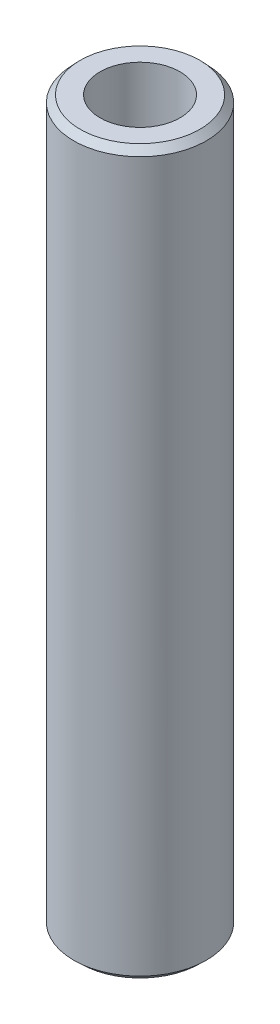
ISO-10303-21;
HEADER;
FILE_DESCRIPTION(('STEP AP214'),'2;1');
FILE_NAME('part.step','',(''),(''),'','','');
FILE_SCHEMA(('AUTOMOTIVE_DESIGN { 1 0 10303 214 1 1 1 1 }'));
ENDSEC;
DATA;
#1=APPLICATION_CONTEXT('core data for automotive mechanical design processes');
#2=APPLICATION_PROTOCOL_DEFINITION('international standard','automotive_design',2000,#1);
#3=PRODUCT_CONTEXT('',#1,'mechanical');
#4=PRODUCT('Part','Part','',(#3));
#5=PRODUCT_RELATED_PRODUCT_CATEGORY('part','',(#4));
#6=PRODUCT_DEFINITION_FORMATION('','',#4);
#7=PRODUCT_DEFINITION_CONTEXT('part definition',#1,'design');
#8=PRODUCT_DEFINITION('design','',#6,#7);
#9=PRODUCT_DEFINITION_SHAPE('','',#8);
#10=(LENGTH_UNIT() NAMED_UNIT(*) SI_UNIT(.MILLI.,.METRE.));
#11=(NAMED_UNIT(*) PLANE_ANGLE_UNIT() SI_UNIT($,.RADIAN.));
#12=(NAMED_UNIT(*) SI_UNIT($,.STERADIAN.) SOLID_ANGLE_UNIT());
#13=UNCERTAINTY_MEASURE_WITH_UNIT(LENGTH_MEASURE(1.E-05),#10,'distance_accuracy_value','');
#14=(GEOMETRIC_REPRESENTATION_CONTEXT(3) GLOBAL_UNCERTAINTY_ASSIGNED_CONTEXT((#13)) GLOBAL_UNIT_ASSIGNED_CONTEXT((#10,
#11,#12)) REPRESENTATION_CONTEXT('',''));
#15=CARTESIAN_POINT('',(0.,0.,0.));
#16=DIRECTION('',(0.,0.,1.));
#17=DIRECTION('',(1.,0.,0.));
#18=AXIS2_PLACEMENT_3D('',#15,#16,#17);
#19=CARTESIAN_POINT('',(0.,600.,0.));
#20=DIRECTION('',(0.,-1.,0.));
#21=DIRECTION('',(0.,0.,-1.));
#22=AXIS2_PLACEMENT_3D('',#19,#20,#21);
#23=CYLINDRICAL_SURFACE('',#22,55.);
#24=CARTESIAN_POINT('',(0.,594.356349089903,0.));
#25=DIRECTION('',(0.,1.,0.));
#26=DIRECTION('',(0.,0.,1.));
#27=AXIS2_PLACEMENT_3D('',#24,#25,#26);
#28=CIRCLE('',#27,55.);
#29=CARTESIAN_POINT('',(0.,594.356349089903,-55.));
#30=VERTEX_POINT('',#29);
#31=EDGE_CURVE('E50',#30,#30,#28,.F.);
#32=ORIENTED_EDGE('',*,*,#31,.T.);
#33=EDGE_LOOP('',(#32));
#34=FACE_BOUND('',#33,.T.);
#35=CARTESIAN_POINT('',(0.,5.33712912611228,0.));
#36=DIRECTION('',(0.,1.,0.));
#37=DIRECTION('',(0.,0.,1.));
#38=AXIS2_PLACEMENT_3D('',#35,#36,#37);
#39=CIRCLE('',#38,55.);
#40=CARTESIAN_POINT('',(0.,5.33712912611228,55.));
#41=VERTEX_POINT('',#40);
#42=EDGE_CURVE('E51',#41,#41,#39,.T.);
#43=ORIENTED_EDGE('',*,*,#42,.T.);
#44=EDGE_LOOP('',(#43));
#45=FACE_BOUND('',#44,.T.);
#46=ADVANCED_FACE('F39',(#34,#45),#23,.T.);
#47=CARTESIAN_POINT('',(0.,600.,0.));
#48=DIRECTION('',(0.,1.,0.));
#49=DIRECTION('',(0.,0.,1.));
#50=AXIS2_PLACEMENT_3D('',#47,#48,#49);
#51=PLANE('',#50);
#52=CARTESIAN_POINT('',(0.,600.,0.));
#53=DIRECTION('',(0.,1.,0.));
#54=DIRECTION('',(0.,0.,1.));
#55=AXIS2_PLACEMENT_3D('',#52,#53,#54);
#56=CIRCLE('',#55,49.6628708738877);
#57=CARTESIAN_POINT('',(0.,600.,-49.6628708738878));
#58=VERTEX_POINT('',#57);
#59=EDGE_CURVE('E54',#58,#58,#56,.T.);
#60=ORIENTED_EDGE('',*,*,#59,.T.);
#61=EDGE_LOOP('',(#60));
#62=FACE_BOUND('',#61,.T.);
#63=CARTESIAN_POINT('',(0.,600.,0.));
#64=DIRECTION('',(0.,1.,0.));
#65=DIRECTION('',(0.,0.,1.));
#66=AXIS2_PLACEMENT_3D('',#63,#64,#65);
#67=CIRCLE('',#66,33.1769553771118);
#68=CARTESIAN_POINT('',(0.,600.,33.1769553771118));
#69=VERTEX_POINT('',#68);
#70=EDGE_CURVE('E58',#69,#69,#67,.T.);
#71=ORIENTED_EDGE('',*,*,#70,.F.);
#72=EDGE_LOOP('',(#71));
#73=FACE_BOUND('',#72,.T.);
#74=ADVANCED_FACE('F69',(#62,#73),#51,.T.);
#75=CARTESIAN_POINT('',(0.,0.,0.));
#76=DIRECTION('',(0.,1.,0.));
#77=DIRECTION('',(0.,0.,1.));
#78=AXIS2_PLACEMENT_3D('',#75,#76,#77);
#79=PLANE('',#78);
#80=CARTESIAN_POINT('',(0.,0.,0.));
#81=DIRECTION('',(0.,1.,0.));
#82=DIRECTION('',(0.,0.,1.));
#83=AXIS2_PLACEMENT_3D('',#80,#81,#82);
#84=CIRCLE('',#83,49.3563490899028);
#85=CARTESIAN_POINT('',(0.,0.,49.3563490899028));
#86=VERTEX_POINT('',#85);
#87=EDGE_CURVE('E10',#86,#86,#84,.F.);
#88=ORIENTED_EDGE('',*,*,#87,.T.);
#89=EDGE_LOOP('',(#88));
#90=FACE_BOUND('',#89,.T.);
#91=CARTESIAN_POINT('',(0.,0.,0.));
#92=DIRECTION('',(0.,1.,0.));
#93=DIRECTION('',(0.,0.,1.));
#94=AXIS2_PLACEMENT_3D('',#91,#92,#93);
#95=CIRCLE('',#94,33.1769553771118);
#96=CARTESIAN_POINT('',(0.,0.,33.1769553771118));
#97=VERTEX_POINT('',#96);
#98=EDGE_CURVE('E63',#97,#97,#95,.T.);
#99=ORIENTED_EDGE('',*,*,#98,.T.);
#100=EDGE_LOOP('',(#99));
#101=FACE_BOUND('',#100,.T.);
#102=ADVANCED_FACE('F75',(#90,#101),#79,.F.);
#103=CARTESIAN_POINT('',(0.,600.,0.));
#104=DIRECTION('',(0.,-1.,0.));
#105=DIRECTION('',(0.,0.,-1.));
#106=AXIS2_PLACEMENT_3D('',#103,#104,#105);
#107=CYLINDRICAL_SURFACE('',#106,33.1769553771118);
#108=ORIENTED_EDGE('',*,*,#70,.T.);
#109=EDGE_LOOP('',(#108));
#110=FACE_BOUND('',#109,.T.);
#111=ORIENTED_EDGE('',*,*,#98,.F.);
#112=EDGE_LOOP('',(#111));
#113=FACE_BOUND('',#112,.T.);
#114=ADVANCED_FACE('F70',(#110,#113),#107,.F.);
#115=CARTESIAN_POINT('',(0.,600.,0.));
#116=DIRECTION('',(0.,-1.,0.));
#117=DIRECTION('',(0.,0.,-1.));
#118=AXIS2_PLACEMENT_3D('',#115,#116,#117);
#119=CONICAL_SURFACE('',#118,49.6628708738877,0.757491019742651);
#120=CARTESIAN_POINT('',(0.,594.356349089903,-55.));
#121=CARTESIAN_POINT('',(0.,594.415137120216,-54.9444049049363));
#122=CARTESIAN_POINT('',(0.,594.47392515053,-54.8888098098727));
#123=CARTESIAN_POINT('',(0.,594.591501211157,-54.7776196197454));
#124=CARTESIAN_POINT('',(0.,594.65028924147,-54.7220245246817));
#125=CARTESIAN_POINT('',(0.,594.767865302097,-54.6108343345544));
#126=CARTESIAN_POINT('',(0.,594.826653332411,-54.5552392394907));
#127=CARTESIAN_POINT('',(0.,594.944229393038,-54.4440490493633));
#128=CARTESIAN_POINT('',(0.,595.003017423351,-54.3884539542997));
#129=CARTESIAN_POINT('',(0.,595.120593483979,-54.2772637641723));
#130=CARTESIAN_POINT('',(0.,595.179381514292,-54.2216686691087));
#131=CARTESIAN_POINT('',(0.,595.296957574919,-54.1104784789813));
#132=CARTESIAN_POINT('',(0.,595.355745605233,-54.0548833839177));
#133=CARTESIAN_POINT('',(0.,595.47332166586,-53.9436931937903));
#134=CARTESIAN_POINT('',(0.,595.532109696173,-53.8880980987267));
#135=CARTESIAN_POINT('',(0.,595.6496857568,-53.7769079085993));
#136=CARTESIAN_POINT('',(0.,595.708473787114,-53.7213128135357));
#137=CARTESIAN_POINT('',(0.,595.826049847741,-53.6101226234083));
#138=CARTESIAN_POINT('',(0.,595.884837878054,-53.5545275283446));
#139=CARTESIAN_POINT('',(0.,596.002413938681,-53.4433373382173));
#140=CARTESIAN_POINT('',(0.,596.061201968995,-53.3877422431536));
#141=CARTESIAN_POINT('',(0.,596.178778029622,-53.2765520530263));
#142=CARTESIAN_POINT('',(0.,596.237566059935,-53.2209569579626));
#143=CARTESIAN_POINT('',(0.,596.355142120562,-53.1097667678353));
#144=CARTESIAN_POINT('',(0.,596.413930150876,-53.0541716727716));
#145=CARTESIAN_POINT('',(0.,596.531506211503,-52.9429814826443));
#146=CARTESIAN_POINT('',(0.,596.590294241816,-52.8873863875806));
#147=CARTESIAN_POINT('',(0.,596.707870302443,-52.7761961974533));
#148=CARTESIAN_POINT('',(0.,596.766658332757,-52.7206011023896));
#149=CARTESIAN_POINT('',(0.,596.884234393384,-52.6094109122622));
#150=CARTESIAN_POINT('',(0.,596.943022423697,-52.5538158171986));
#151=CARTESIAN_POINT('',(0.,597.060598484324,-52.4426256270713));
#152=CARTESIAN_POINT('',(0.,597.119386514638,-52.3870305320076));
#153=CARTESIAN_POINT('',(0.,597.236962575265,-52.2758403418802));
#154=CARTESIAN_POINT('',(0.,597.295750605579,-52.2202452468166));
#155=CARTESIAN_POINT('',(0.,597.413326666206,-52.1090550566892));
#156=CARTESIAN_POINT('',(0.,597.472114696519,-52.0534599616256));
#157=CARTESIAN_POINT('',(0.,597.589690757146,-51.9422697714982));
#158=CARTESIAN_POINT('',(0.,597.64847878746,-51.8866746764345));
#159=CARTESIAN_POINT('',(0.,597.766054848087,-51.7754844863072));
#160=CARTESIAN_POINT('',(0.,597.8248428784,-51.7198893912435));
#161=CARTESIAN_POINT('',(0.,597.942418939027,-51.6086992011162));
#162=CARTESIAN_POINT('',(0.,598.001206969341,-51.5531041060526));
#163=CARTESIAN_POINT('',(0.,598.118783029968,-51.4419139159252));
#164=CARTESIAN_POINT('',(0.,598.177571060281,-51.3863188208615));
#165=CARTESIAN_POINT('',(0.,598.295147120908,-51.2751286307342));
#166=CARTESIAN_POINT('',(0.,598.353935151222,-51.2195335356705));
#167=CARTESIAN_POINT('',(0.,598.471511211849,-51.1083433455432));
#168=CARTESIAN_POINT('',(0.,598.530299242162,-51.0527482504795));
#169=CARTESIAN_POINT('',(0.,598.647875302789,-50.9415580603522));
#170=CARTESIAN_POINT('',(0.,598.706663333103,-50.8859629652885));
#171=CARTESIAN_POINT('',(0.,598.82423939373,-50.7747727751612));
#172=CARTESIAN_POINT('',(0.,598.883027424043,-50.7191776800975));
#173=CARTESIAN_POINT('',(0.,599.00060348467,-50.6079874899702));
#174=CARTESIAN_POINT('',(0.,599.059391514984,-50.5523923949065));
#175=CARTESIAN_POINT('',(0.,599.176967575611,-50.4412022047791));
#176=CARTESIAN_POINT('',(0.,599.235755605924,-50.3856071097155));
#177=CARTESIAN_POINT('',(0.,599.353331666551,-50.2744169195881));
#178=CARTESIAN_POINT('',(0.,599.412119696865,-50.2188218245245));
#179=CARTESIAN_POINT('',(0.,599.529695757492,-50.1076316343971));
#180=CARTESIAN_POINT('',(0.,599.588483787805,-50.0520365393335));
#181=CARTESIAN_POINT('',(0.,599.706059848432,-49.9408463492061));
#182=CARTESIAN_POINT('',(0.,599.764847878746,-49.8852512541424));
#183=CARTESIAN_POINT('',(0.,599.882423939373,-49.7740610640151));
#184=CARTESIAN_POINT('',(0.,599.941211969686,-49.7184659689514));
#185=CARTESIAN_POINT('',(0.,600.,-49.6628708738878));
#186=B_SPLINE_CURVE_WITH_KNOTS('',3,(#120,#121,#122,#123,#124,#125,#126,#127,#128,#129,#130,
#131,#132,#133,#134,#135,#136,#137,#138,#139,#140,#141,#142,#143,#144,#145,#146,#147,#148,#149,
#150,#151,#152,#153,#154,#155,#156,#157,#158,#159,#160,#161,#162,#163,#164,#165,#166,#167,#168,
#169,#170,#171,#172,#173,#174,#175,#176,#177,#178,#179,#180,#181,#182,#183,#184,#185),
.UNSPECIFIED.,.F.,.F.,(4,2,2,2,2,2,2,2,2,2,2,2,2,2,2,2,2,2,2,2,2,2,2,2,2,2,2,2,2,2,2,2,4),(0.,
0.242737767826724,0.485475535653528,0.728213303480257,0.970951071307066,1.21368883913387,
1.45642660696059,1.6991643747874,1.94190214261421,2.18463991044094,2.42737767826774,
2.67011544609447,2.91285321392128,3.15559098174808,3.39832874957481,3.64106651740162,
3.88380428522843,4.12654205305515,4.36927982088195,4.61201758870868,4.85475535653549,
5.0974931243623,5.34023089218902,5.58296866001583,5.82570642784263,6.06844419566936,
6.31118196349617,6.55391973132289,6.7966574991497,7.03939526697651,7.28213303480323,
7.52487080263004,7.76760857045685),.UNSPECIFIED.);
#187=EDGE_CURVE('BSEAM81',#30,#58,#186,.T.);
#188=ORIENTED_EDGE('',*,*,#31,.F.);
#189=ORIENTED_EDGE('',*,*,#59,.F.);
#190=ORIENTED_EDGE('',*,*,#187,.T.);
#191=ORIENTED_EDGE('',*,*,#187,.F.);
#192=EDGE_LOOP('',(#188,#190,#189,#191));
#193=FACE_BOUND('',#192,.T.);
#194=ADVANCED_FACE('F81',(#193),#119,.T.);
#195=CARTESIAN_POINT('',(0.,5.33712912611228,0.));
#196=DIRECTION('',(0.,1.,0.));
#197=DIRECTION('',(0.,0.,1.));
#198=AXIS2_PLACEMENT_3D('',#195,#196,#197);
#199=CONICAL_SURFACE('',#198,55.,0.813305307052262);
#200=ORIENTED_EDGE('',*,*,#87,.F.);
#201=EDGE_LOOP('',(#200));
#202=FACE_BOUND('',#201,.T.);
#203=ORIENTED_EDGE('',*,*,#42,.F.);
#204=EDGE_LOOP('',(#203));
#205=FACE_BOUND('',#204,.T.);
#206=ADVANCED_FACE('F45',(#202,#205),#199,.T.);
#207=CLOSED_SHELL('',(#46,#74,#102,#114,#194,#206));
#208=MANIFOLD_SOLID_BREP('B2',#207);
#209=ADVANCED_BREP_SHAPE_REPRESENTATION('',(#18,#208),#14);
#210=SHAPE_DEFINITION_REPRESENTATION(#9,#209);
ENDSEC;
END-ISO-10303-21;
